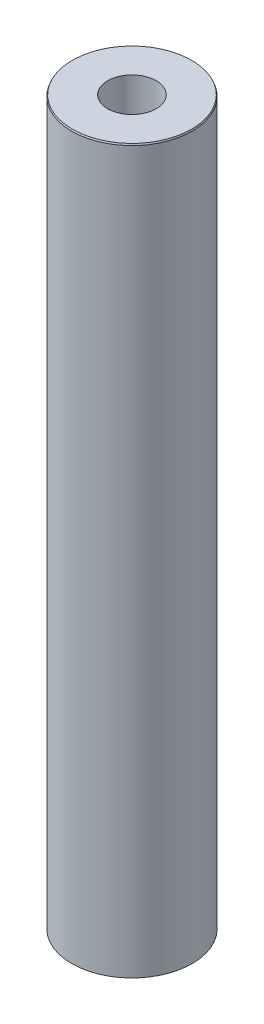
ISO-10303-21;
HEADER;
FILE_DESCRIPTION(('STEP AP214'),'2;1');
FILE_NAME('part.step','',(''),(''),'','','');
FILE_SCHEMA(('AUTOMOTIVE_DESIGN { 1 0 10303 214 1 1 1 1 }'));
ENDSEC;
DATA;
#1=APPLICATION_CONTEXT('core data for automotive mechanical design processes');
#2=APPLICATION_PROTOCOL_DEFINITION('international standard','automotive_design',2000,#1);
#3=PRODUCT_CONTEXT('',#1,'mechanical');
#4=PRODUCT('Part','Part','',(#3));
#5=PRODUCT_RELATED_PRODUCT_CATEGORY('part','',(#4));
#6=PRODUCT_DEFINITION_FORMATION('','',#4);
#7=PRODUCT_DEFINITION_CONTEXT('part definition',#1,'design');
#8=PRODUCT_DEFINITION('design','',#6,#7);
#9=PRODUCT_DEFINITION_SHAPE('','',#8);
#10=(LENGTH_UNIT() NAMED_UNIT(*) SI_UNIT(.MILLI.,.METRE.));
#11=(NAMED_UNIT(*) PLANE_ANGLE_UNIT() SI_UNIT($,.RADIAN.));
#12=(NAMED_UNIT(*) SI_UNIT($,.STERADIAN.) SOLID_ANGLE_UNIT());
#13=UNCERTAINTY_MEASURE_WITH_UNIT(LENGTH_MEASURE(1.E-05),#10,'distance_accuracy_value','');
#14=(GEOMETRIC_REPRESENTATION_CONTEXT(3) GLOBAL_UNCERTAINTY_ASSIGNED_CONTEXT((#13)) GLOBAL_UNIT_ASSIGNED_CONTEXT((#10,
#11,#12)) REPRESENTATION_CONTEXT('',''));
#15=CARTESIAN_POINT('',(0.,0.,0.));
#16=DIRECTION('',(0.,0.,1.));
#17=DIRECTION('',(1.,0.,0.));
#18=AXIS2_PLACEMENT_3D('',#15,#16,#17);
#19=CARTESIAN_POINT('',(0.,600.,0.));
#20=DIRECTION('',(0.,-1.,0.));
#21=DIRECTION('',(0.,0.,-1.));
#22=AXIS2_PLACEMENT_3D('',#19,#20,#21);
#23=CYLINDRICAL_SURFACE('',#22,50.);
#24=CARTESIAN_POINT('',(0.,598.75642216687,0.));
#25=DIRECTION('',(0.,1.,0.));
#26=DIRECTION('',(0.,0.,1.));
#27=AXIS2_PLACEMENT_3D('',#24,#25,#26);
#28=CIRCLE('',#27,50.);
#29=CARTESIAN_POINT('',(0.,598.75642216687,50.));
#30=VERTEX_POINT('',#29);
#31=EDGE_CURVE('E50',#30,#30,#28,.F.);
#32=ORIENTED_EDGE('',*,*,#31,.T.);
#33=EDGE_LOOP('',(#32));
#34=FACE_BOUND('',#33,.T.);
#35=CARTESIAN_POINT('',(0.,0.48599640476843,0.));
#36=DIRECTION('',(0.,1.,0.));
#37=DIRECTION('',(0.,0.,1.));
#38=AXIS2_PLACEMENT_3D('',#35,#36,#37);
#39=CIRCLE('',#38,50.);
#40=CARTESIAN_POINT('',(0.,0.48599640476843,50.));
#41=VERTEX_POINT('',#40);
#42=EDGE_CURVE('E51',#41,#41,#39,.T.);
#43=ORIENTED_EDGE('',*,*,#42,.T.);
#44=EDGE_LOOP('',(#43));
#45=FACE_BOUND('',#44,.T.);
#46=ADVANCED_FACE('F39',(#34,#45),#23,.T.);
#47=CARTESIAN_POINT('',(0.,600.,0.));
#48=DIRECTION('',(0.,1.,0.));
#49=DIRECTION('',(0.,0.,1.));
#50=AXIS2_PLACEMENT_3D('',#47,#48,#49);
#51=PLANE('',#50);
#52=CARTESIAN_POINT('',(0.,600.,0.));
#53=DIRECTION('',(0.,1.,0.));
#54=DIRECTION('',(0.,0.,1.));
#55=AXIS2_PLACEMENT_3D('',#52,#53,#54);
#56=CIRCLE('',#55,49.5140035952316);
#57=CARTESIAN_POINT('',(0.,600.,49.5140035952316));
#58=VERTEX_POINT('',#57);
#59=EDGE_CURVE('E54',#58,#58,#56,.T.);
#60=ORIENTED_EDGE('',*,*,#59,.T.);
#61=EDGE_LOOP('',(#60));
#62=FACE_BOUND('',#61,.T.);
#63=CARTESIAN_POINT('',(0.,600.,0.));
#64=DIRECTION('',(0.,1.,0.));
#65=DIRECTION('',(0.,0.,1.));
#66=AXIS2_PLACEMENT_3D('',#63,#64,#65);
#67=CIRCLE('',#66,20.1542414028655);
#68=CARTESIAN_POINT('',(0.,600.,20.1542414028655));
#69=VERTEX_POINT('',#68);
#70=EDGE_CURVE('E58',#69,#69,#67,.T.);
#71=ORIENTED_EDGE('',*,*,#70,.F.);
#72=EDGE_LOOP('',(#71));
#73=FACE_BOUND('',#72,.T.);
#74=ADVANCED_FACE('F69',(#62,#73),#51,.T.);
#75=CARTESIAN_POINT('',(0.,0.,0.));
#76=DIRECTION('',(0.,1.,0.));
#77=DIRECTION('',(0.,0.,1.));
#78=AXIS2_PLACEMENT_3D('',#75,#76,#77);
#79=PLANE('',#78);
#80=CARTESIAN_POINT('',(0.,0.,0.));
#81=DIRECTION('',(0.,1.,0.));
#82=DIRECTION('',(0.,0.,1.));
#83=AXIS2_PLACEMENT_3D('',#80,#81,#82);
#84=CIRCLE('',#83,48.7564221668696);
#85=CARTESIAN_POINT('',(0.,0.,48.7564221668696));
#86=VERTEX_POINT('',#85);
#87=EDGE_CURVE('E10',#86,#86,#84,.F.);
#88=ORIENTED_EDGE('',*,*,#87,.T.);
#89=EDGE_LOOP('',(#88));
#90=FACE_BOUND('',#89,.T.);
#91=CARTESIAN_POINT('',(0.,0.,0.));
#92=DIRECTION('',(0.,1.,0.));
#93=DIRECTION('',(0.,0.,1.));
#94=AXIS2_PLACEMENT_3D('',#91,#92,#93);
#95=CIRCLE('',#94,20.1542414028655);
#96=CARTESIAN_POINT('',(0.,0.,20.1542414028655));
#97=VERTEX_POINT('',#96);
#98=EDGE_CURVE('E63',#97,#97,#95,.T.);
#99=ORIENTED_EDGE('',*,*,#98,.T.);
#100=EDGE_LOOP('',(#99));
#101=FACE_BOUND('',#100,.T.);
#102=ADVANCED_FACE('F75',(#90,#101),#79,.F.);
#103=CARTESIAN_POINT('',(0.,600.,0.));
#104=DIRECTION('',(0.,-1.,0.));
#105=DIRECTION('',(0.,0.,-1.));
#106=AXIS2_PLACEMENT_3D('',#103,#104,#105);
#107=CYLINDRICAL_SURFACE('',#106,20.1542414028655);
#108=ORIENTED_EDGE('',*,*,#70,.T.);
#109=EDGE_LOOP('',(#108));
#110=FACE_BOUND('',#109,.T.);
#111=ORIENTED_EDGE('',*,*,#98,.F.);
#112=EDGE_LOOP('',(#111));
#113=FACE_BOUND('',#112,.T.);
#114=ADVANCED_FACE('F70',(#110,#113),#107,.F.);
#115=CARTESIAN_POINT('',(0.,600.,0.));
#116=DIRECTION('',(0.,-1.,0.));
#117=DIRECTION('',(0.,0.,-1.));
#118=AXIS2_PLACEMENT_3D('',#115,#116,#117);
#119=CONICAL_SURFACE('',#118,49.5140035952316,0.372554586309302);
#120=ORIENTED_EDGE('',*,*,#31,.F.);
#121=EDGE_LOOP('',(#120));
#122=FACE_BOUND('',#121,.T.);
#123=ORIENTED_EDGE('',*,*,#59,.F.);
#124=EDGE_LOOP('',(#123));
#125=FACE_BOUND('',#124,.T.);
#126=ADVANCED_FACE('F81',(#122,#125),#119,.T.);
#127=CARTESIAN_POINT('',(0.,0.48599640476843,0.));
#128=DIRECTION('',(0.,1.,0.));
#129=DIRECTION('',(0.,0.,1.));
#130=AXIS2_PLACEMENT_3D('',#127,#128,#129);
#131=CONICAL_SURFACE('',#130,50.,1.19824174048556);
#132=ORIENTED_EDGE('',*,*,#87,.F.);
#133=EDGE_LOOP('',(#132));
#134=FACE_BOUND('',#133,.T.);
#135=ORIENTED_EDGE('',*,*,#42,.F.);
#136=EDGE_LOOP('',(#135));
#137=FACE_BOUND('',#136,.T.);
#138=ADVANCED_FACE('F45',(#134,#137),#131,.T.);
#139=CLOSED_SHELL('',(#46,#74,#102,#114,#126,#138));
#140=MANIFOLD_SOLID_BREP('B2',#139);
#141=ADVANCED_BREP_SHAPE_REPRESENTATION('',(#18,#140),#14);
#142=SHAPE_DEFINITION_REPRESENTATION(#9,#141);
ENDSEC;
END-ISO-10303-21;
